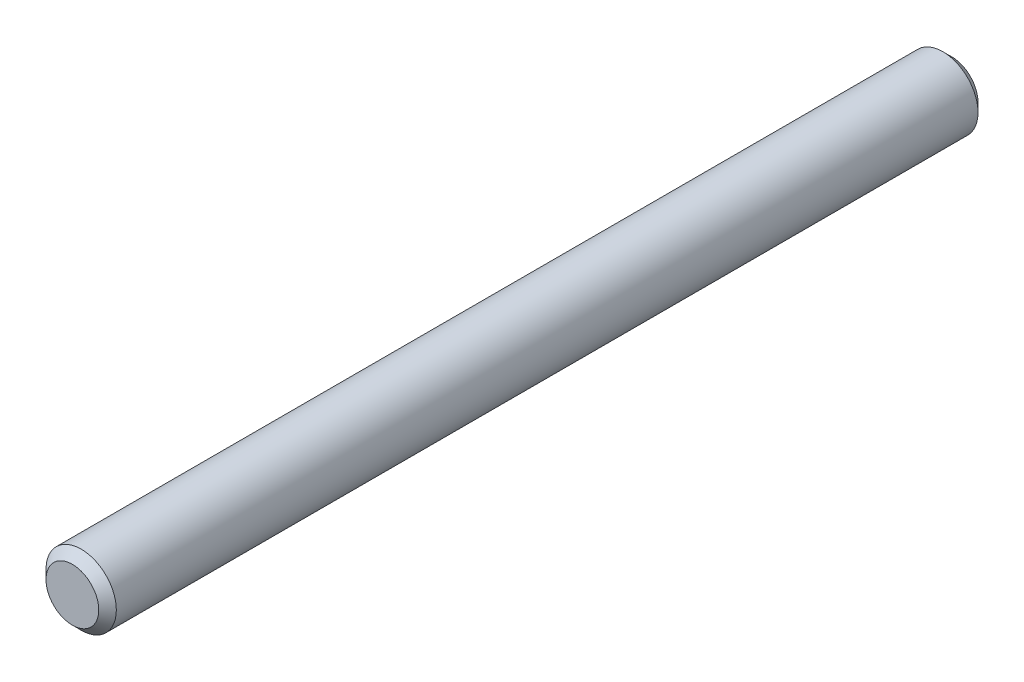
ISO-10303-21;
HEADER;
FILE_DESCRIPTION(('STEP AP214'),'2;1');
FILE_NAME('part.step','',(''),(''),'','','');
FILE_SCHEMA(('AUTOMOTIVE_DESIGN { 1 0 10303 214 1 1 1 1 }'));
ENDSEC;
DATA;
#1=APPLICATION_CONTEXT('core data for automotive mechanical design processes');
#2=APPLICATION_PROTOCOL_DEFINITION('international standard','automotive_design',2000,#1);
#3=PRODUCT_CONTEXT('',#1,'mechanical');
#4=PRODUCT('Part','Part','',(#3));
#5=PRODUCT_RELATED_PRODUCT_CATEGORY('part','',(#4));
#6=PRODUCT_DEFINITION_FORMATION('','',#4);
#7=PRODUCT_DEFINITION_CONTEXT('part definition',#1,'design');
#8=PRODUCT_DEFINITION('design','',#6,#7);
#9=PRODUCT_DEFINITION_SHAPE('','',#8);
#10=(LENGTH_UNIT() NAMED_UNIT(*) SI_UNIT(.MILLI.,.METRE.));
#11=(NAMED_UNIT(*) PLANE_ANGLE_UNIT() SI_UNIT($,.RADIAN.));
#12=(NAMED_UNIT(*) SI_UNIT($,.STERADIAN.) SOLID_ANGLE_UNIT());
#13=UNCERTAINTY_MEASURE_WITH_UNIT(LENGTH_MEASURE(1.E-05),#10,'distance_accuracy_value','');
#14=(GEOMETRIC_REPRESENTATION_CONTEXT(3) GLOBAL_UNCERTAINTY_ASSIGNED_CONTEXT((#13)) GLOBAL_UNIT_ASSIGNED_CONTEXT((#10,
#11,#12)) REPRESENTATION_CONTEXT('',''));
#15=CARTESIAN_POINT('',(0.,0.,0.));
#16=DIRECTION('',(0.,0.,1.));
#17=DIRECTION('',(1.,0.,0.));
#18=AXIS2_PLACEMENT_3D('',#15,#16,#17);
#19=CARTESIAN_POINT('',(0.,0.,25.));
#20=DIRECTION('',(0.,0.,-1.));
#21=DIRECTION('',(-1.,0.,0.));
#22=AXIS2_PLACEMENT_3D('',#19,#20,#21);
#23=CYLINDRICAL_SURFACE('',#22,2.);
#24=CARTESIAN_POINT('',(0.,0.,-24.5));
#25=DIRECTION('',(0.,0.,1.));
#26=DIRECTION('',(1.,0.,0.));
#27=AXIS2_PLACEMENT_3D('',#24,#25,#26);
#28=CIRCLE('',#27,2.);
#29=CARTESIAN_POINT('',(2.,0.,-24.5));
#30=VERTEX_POINT('',#29);
#31=EDGE_CURVE('E29',#30,#30,#28,.T.);
#32=ORIENTED_EDGE('',*,*,#31,.T.);
#33=EDGE_LOOP('',(#32));
#34=FACE_BOUND('',#33,.T.);
#35=CARTESIAN_POINT('',(0.,0.,24.5));
#36=DIRECTION('',(0.,0.,1.));
#37=DIRECTION('',(1.,0.,0.));
#38=AXIS2_PLACEMENT_3D('',#35,#36,#37);
#39=CIRCLE('',#38,2.);
#40=CARTESIAN_POINT('',(2.,0.,24.5));
#41=VERTEX_POINT('',#40);
#42=EDGE_CURVE('E33',#41,#41,#39,.F.);
#43=ORIENTED_EDGE('',*,*,#42,.T.);
#44=EDGE_LOOP('',(#43));
#45=FACE_BOUND('',#44,.T.);
#46=ADVANCED_FACE('F17',(#34,#45),#23,.T.);
#47=CARTESIAN_POINT('',(0.,0.,25.));
#48=DIRECTION('',(0.,0.,1.));
#49=DIRECTION('',(1.,0.,0.));
#50=AXIS2_PLACEMENT_3D('',#47,#48,#49);
#51=PLANE('',#50);
#52=CARTESIAN_POINT('',(0.,0.,25.));
#53=DIRECTION('',(0.,0.,1.));
#54=DIRECTION('',(1.,0.,0.));
#55=AXIS2_PLACEMENT_3D('',#52,#53,#54);
#56=CIRCLE('',#55,1.5);
#57=CARTESIAN_POINT('',(1.5,0.,25.));
#58=VERTEX_POINT('',#57);
#59=EDGE_CURVE('E10',#58,#58,#56,.T.);
#60=ORIENTED_EDGE('',*,*,#59,.T.);
#61=EDGE_LOOP('',(#60));
#62=FACE_BOUND('',#61,.T.);
#63=ADVANCED_FACE('F50',(#62),#51,.T.);
#64=CARTESIAN_POINT('',(0.,0.,-25.));
#65=DIRECTION('',(0.,0.,1.));
#66=DIRECTION('',(1.,0.,0.));
#67=AXIS2_PLACEMENT_3D('',#64,#65,#66);
#68=PLANE('',#67);
#69=CARTESIAN_POINT('',(0.,0.,-25.));
#70=DIRECTION('',(0.,0.,1.));
#71=DIRECTION('',(1.,0.,0.));
#72=AXIS2_PLACEMENT_3D('',#69,#70,#71);
#73=CIRCLE('',#72,1.49999999999999);
#74=CARTESIAN_POINT('',(1.49999999999999,0.,-25.));
#75=VERTEX_POINT('',#74);
#76=EDGE_CURVE('E25',#75,#75,#73,.F.);
#77=ORIENTED_EDGE('',*,*,#76,.T.);
#78=EDGE_LOOP('',(#77));
#79=FACE_BOUND('',#78,.T.);
#80=ADVANCED_FACE('F47',(#79),#68,.F.);
#81=CARTESIAN_POINT('',(0.,0.,-24.5));
#82=DIRECTION('',(0.,0.,1.));
#83=DIRECTION('',(1.,0.,0.));
#84=AXIS2_PLACEMENT_3D('',#81,#82,#83);
#85=CONICAL_SURFACE('',#84,2.,0.785398163397453);
#86=ORIENTED_EDGE('',*,*,#76,.F.);
#87=EDGE_LOOP('',(#86));
#88=FACE_BOUND('',#87,.T.);
#89=ORIENTED_EDGE('',*,*,#31,.F.);
#90=EDGE_LOOP('',(#89));
#91=FACE_BOUND('',#90,.T.);
#92=ADVANCED_FACE('F42',(#88,#91),#85,.T.);
#93=CARTESIAN_POINT('',(0.,0.,25.));
#94=DIRECTION('',(0.,0.,-1.));
#95=DIRECTION('',(-1.,0.,0.));
#96=AXIS2_PLACEMENT_3D('',#93,#94,#95);
#97=CONICAL_SURFACE('',#96,1.5,0.785398163397439);
#98=ORIENTED_EDGE('',*,*,#42,.F.);
#99=EDGE_LOOP('',(#98));
#100=FACE_BOUND('',#99,.T.);
#101=ORIENTED_EDGE('',*,*,#59,.F.);
#102=EDGE_LOOP('',(#101));
#103=FACE_BOUND('',#102,.T.);
#104=ADVANCED_FACE('F20',(#100,#103),#97,.T.);
#105=CLOSED_SHELL('',(#46,#63,#80,#92,#104));
#106=MANIFOLD_SOLID_BREP('B1',#105);
#107=ADVANCED_BREP_SHAPE_REPRESENTATION('',(#18,#106),#14);
#108=SHAPE_DEFINITION_REPRESENTATION(#9,#107);
ENDSEC;
END-ISO-10303-21;
